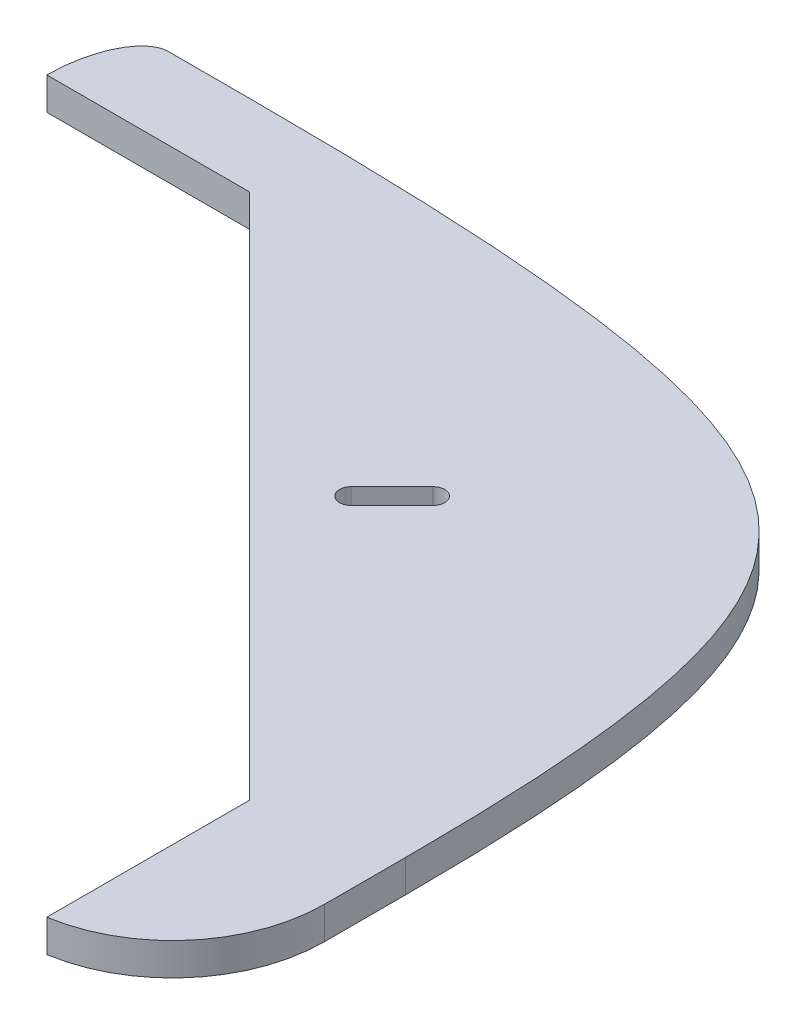
ISO-10303-21;
HEADER;
FILE_DESCRIPTION(('STEP AP214'),'2;1');
FILE_NAME('part.step','',(''),(''),'','','');
FILE_SCHEMA(('AUTOMOTIVE_DESIGN { 1 0 10303 214 1 1 1 1 }'));
ENDSEC;
DATA;
#1=APPLICATION_CONTEXT('core data for automotive mechanical design processes');
#2=APPLICATION_PROTOCOL_DEFINITION('international standard','automotive_design',2000,#1);
#3=PRODUCT_CONTEXT('',#1,'mechanical');
#4=PRODUCT('Part','Part','',(#3));
#5=PRODUCT_RELATED_PRODUCT_CATEGORY('part','',(#4));
#6=PRODUCT_DEFINITION_FORMATION('','',#4);
#7=PRODUCT_DEFINITION_CONTEXT('part definition',#1,'design');
#8=PRODUCT_DEFINITION('design','',#6,#7);
#9=PRODUCT_DEFINITION_SHAPE('','',#8);
#10=(LENGTH_UNIT() NAMED_UNIT(*) SI_UNIT(.MILLI.,.METRE.));
#11=(NAMED_UNIT(*) PLANE_ANGLE_UNIT() SI_UNIT($,.RADIAN.));
#12=(NAMED_UNIT(*) SI_UNIT($,.STERADIAN.) SOLID_ANGLE_UNIT());
#13=UNCERTAINTY_MEASURE_WITH_UNIT(LENGTH_MEASURE(1.E-05),#10,'distance_accuracy_value','');
#14=(GEOMETRIC_REPRESENTATION_CONTEXT(3) GLOBAL_UNCERTAINTY_ASSIGNED_CONTEXT((#13)) GLOBAL_UNIT_ASSIGNED_CONTEXT((#10,
#11,#12)) REPRESENTATION_CONTEXT('',''));
#15=CARTESIAN_POINT('',(0.,0.,0.));
#16=DIRECTION('',(0.,0.,1.));
#17=DIRECTION('',(1.,0.,0.));
#18=AXIS2_PLACEMENT_3D('',#15,#16,#17);
#19=CARTESIAN_POINT('',(12.7,5.08,-12.6999999999999));
#20=DIRECTION('',(0.,-1.,0.));
#21=DIRECTION('',(0.,0.,-1.));
#22=AXIS2_PLACEMENT_3D('',#19,#20,#21);
#23=PLANE('',#22);
#24=DIRECTION('',(-1.,0.,0.));
#25=VECTOR('',#24,1.);
#26=CARTESIAN_POINT('',(0.,5.08,-120.65));
#27=LINE('',#26,#25);
#28=CARTESIAN_POINT('',(12.7,5.08,-120.65));
#29=VERTEX_POINT('',#28);
#30=CARTESIAN_POINT('',(0.,5.08,-120.65));
#31=VERTEX_POINT('',#30);
#32=EDGE_CURVE('E156',#29,#31,#27,.T.);
#33=ORIENTED_EDGE('',*,*,#32,.T.);
#34=CARTESIAN_POINT('',(-6.35,5.08,-107.95));
#35=CARTESIAN_POINT('',(-6.35,5.08,-120.65));
#36=CARTESIAN_POINT('',(0.,5.08,-120.65));
#37=(BOUNDED_CURVE() B_SPLINE_CURVE(2,(#34,#35,#36),.UNSPECIFIED.,.F.,
.F.) B_SPLINE_CURVE_WITH_KNOTS((3,3),(0.,1.),
.UNSPECIFIED.) CURVE() GEOMETRIC_REPRESENTATION_ITEM() RATIONAL_B_SPLINE_CURVE((1.,
0.707106781186548,1.)) REPRESENTATION_ITEM(''));
#38=CARTESIAN_POINT('',(-6.35,5.08,-107.95));
#39=VERTEX_POINT('',#38);
#40=EDGE_CURVE('E12',#31,#39,#37,.F.);
#41=ORIENTED_EDGE('',*,*,#40,.T.);
#42=DIRECTION('',(1.,0.,0.));
#43=VECTOR('',#42,1.);
#44=CARTESIAN_POINT('',(0.,5.08,-107.95));
#45=LINE('',#44,#43);
#46=CARTESIAN_POINT('',(25.4,5.08,-107.95));
#47=VERTEX_POINT('',#46);
#48=EDGE_CURVE('E234',#39,#47,#45,.T.);
#49=ORIENTED_EDGE('',*,*,#48,.T.);
#50=DIRECTION('',(0.707106781186547,0.,0.707106781186547));
#51=VECTOR('',#50,1.);
#52=CARTESIAN_POINT('',(25.4,5.08,-107.95));
#53=LINE('',#52,#51);
#54=CARTESIAN_POINT('',(107.95,5.08,-25.4));
#55=VERTEX_POINT('',#54);
#56=EDGE_CURVE('E152',#47,#55,#53,.T.);
#57=ORIENTED_EDGE('',*,*,#56,.T.);
#58=DIRECTION('',(0.,0.,1.));
#59=VECTOR('',#58,1.);
#60=CARTESIAN_POINT('',(107.95,5.08,-25.4));
#61=LINE('',#60,#59);
#62=CARTESIAN_POINT('',(107.95,5.08,6.35));
#63=VERTEX_POINT('',#62);
#64=EDGE_CURVE('E149',#55,#63,#61,.T.);
#65=ORIENTED_EDGE('',*,*,#64,.T.);
#66=CARTESIAN_POINT('',(104.132871956947,5.08,-17.1592560861063));
#67=DIRECTION('',(0.,1.,0.));
#68=DIRECTION('',(0.,0.,1.));
#69=AXIS2_PLACEMENT_3D('',#66,#67,#68);
#70=CIRCLE('',#69,23.8171280430532);
#71=CARTESIAN_POINT('',(127.95,5.08,-17.1592560861063));
#72=VERTEX_POINT('',#71);
#73=EDGE_CURVE('E136',#72,#63,#70,.F.);
#74=ORIENTED_EDGE('',*,*,#73,.F.);
#75=DIRECTION('',(0.,0.,-1.));
#76=VECTOR('',#75,1.);
#77=CARTESIAN_POINT('',(127.95,5.08,0.));
#78=LINE('',#77,#76);
#79=CARTESIAN_POINT('',(127.95,5.08,-29.8592560861063));
#80=VERTEX_POINT('',#79);
#81=EDGE_CURVE('E146',#72,#80,#78,.T.);
#82=ORIENTED_EDGE('',*,*,#81,.T.);
#83=CARTESIAN_POINT('',(127.95,5.08,-29.8592560861063));
#84=CARTESIAN_POINT('',(127.95,5.08,-120.65));
#85=CARTESIAN_POINT('',(12.7,5.08,-120.65));
#86=(BOUNDED_CURVE() B_SPLINE_CURVE(2,(#83,#84,#85),.UNSPECIFIED.,.F.,
.F.) B_SPLINE_CURVE_WITH_KNOTS((3,3),(0.,1.),
.UNSPECIFIED.) CURVE() GEOMETRIC_REPRESENTATION_ITEM() RATIONAL_B_SPLINE_CURVE((1.,1.88125,1.)) REPRESENTATION_ITEM(''));
#87=EDGE_CURVE('E167',#80,#29,#86,.T.);
#88=ORIENTED_EDGE('',*,*,#87,.T.);
#89=EDGE_LOOP('',(#33,#41,#49,#57,#65,#74,#82,#88));
#90=FACE_BOUND('',#89,.T.);
#91=CARTESIAN_POINT('',(74.6362526601451,5.08,-74.6362526601451));
#92=DIRECTION('',(0.,1.,0.));
#93=DIRECTION('',(0.,0.,1.));
#94=AXIS2_PLACEMENT_3D('',#91,#92,#93);
#95=CIRCLE('',#94,1.79999999999998);
#96=CARTESIAN_POINT('',(73.3634604540094,5.08,-75.9090448662809));
#97=VERTEX_POINT('',#96);
#98=CARTESIAN_POINT('',(75.9090448662809,5.08,-73.3634604540094));
#99=VERTEX_POINT('',#98);
#100=EDGE_CURVE('E192',#97,#99,#95,.T.);
#101=ORIENTED_EDGE('',*,*,#100,.F.);
#102=DIRECTION('',(-0.707106781186548,0.,0.707106781186548));
#103=VECTOR('',#102,1.);
#104=CARTESIAN_POINT('',(73.3634604540094,5.08,-75.9090448662809));
#105=LINE('',#104,#103);
#106=CARTESIAN_POINT('',(79.7981321628069,5.08,-82.3437165750784));
#107=VERTEX_POINT('',#106);
#108=EDGE_CURVE('E299',#107,#97,#105,.T.);
#109=ORIENTED_EDGE('',*,*,#108,.F.);
#110=CARTESIAN_POINT('',(81.0709243689427,5.08,-81.0709243689427));
#111=DIRECTION('',(0.,1.,0.));
#112=DIRECTION('',(0.,0.,1.));
#113=AXIS2_PLACEMENT_3D('',#110,#111,#112);
#114=CIRCLE('',#113,1.79999999999998);
#115=CARTESIAN_POINT('',(82.3437165750784,5.08,-79.7981321628069));
#116=VERTEX_POINT('',#115);
#117=EDGE_CURVE('E359',#116,#107,#114,.T.);
#118=ORIENTED_EDGE('',*,*,#117,.F.);
#119=DIRECTION('',(0.707106781186548,0.,-0.707106781186548));
#120=VECTOR('',#119,1.);
#121=CARTESIAN_POINT('',(75.9090448662809,5.08,-73.3634604540094));
#122=LINE('',#121,#120);
#123=EDGE_CURVE('E358',#99,#116,#122,.T.);
#124=ORIENTED_EDGE('',*,*,#123,.F.);
#125=EDGE_LOOP('',(#101,#109,#118,#124));
#126=FACE_BOUND('',#125,.T.);
#127=ADVANCED_FACE('F39',(#90,#126),#23,.F.);
#128=CARTESIAN_POINT('',(12.7,0.,-12.6999999999999));
#129=DIRECTION('',(0.,-1.,0.));
#130=DIRECTION('',(0.,0.,-1.));
#131=AXIS2_PLACEMENT_3D('',#128,#129,#130);
#132=PLANE('',#131);
#133=DIRECTION('',(1.,0.,0.));
#134=VECTOR('',#133,1.);
#135=CARTESIAN_POINT('',(0.,0.,-107.95));
#136=LINE('',#135,#134);
#137=CARTESIAN_POINT('',(-6.35,0.,-107.95));
#138=VERTEX_POINT('',#137);
#139=CARTESIAN_POINT('',(25.4,0.,-107.95));
#140=VERTEX_POINT('',#139);
#141=EDGE_CURVE('E287',#138,#140,#136,.T.);
#142=ORIENTED_EDGE('',*,*,#141,.F.);
#143=CARTESIAN_POINT('',(0.,0.,-120.65));
#144=CARTESIAN_POINT('',(-6.35,0.,-120.65));
#145=CARTESIAN_POINT('',(-6.35,0.,-107.95));
#146=(BOUNDED_CURVE() B_SPLINE_CURVE(2,(#143,#144,#145),.UNSPECIFIED.,.F.,
.F.) B_SPLINE_CURVE_WITH_KNOTS((3,3),(0.,1.),
.UNSPECIFIED.) CURVE() GEOMETRIC_REPRESENTATION_ITEM() RATIONAL_B_SPLINE_CURVE((1.,
0.707106781186548,1.)) REPRESENTATION_ITEM(''));
#147=CARTESIAN_POINT('',(0.,0.,-120.65));
#148=VERTEX_POINT('',#147);
#149=EDGE_CURVE('E68',#138,#148,#146,.F.);
#150=ORIENTED_EDGE('',*,*,#149,.T.);
#151=DIRECTION('',(-1.,0.,0.));
#152=VECTOR('',#151,1.);
#153=CARTESIAN_POINT('',(0.,0.,-120.65));
#154=LINE('',#153,#152);
#155=CARTESIAN_POINT('',(12.7,0.,-120.65));
#156=VERTEX_POINT('',#155);
#157=EDGE_CURVE('E241',#156,#148,#154,.T.);
#158=ORIENTED_EDGE('',*,*,#157,.F.);
#159=CARTESIAN_POINT('',(127.95,0.,-29.8592560861063));
#160=CARTESIAN_POINT('',(127.95,0.,-120.65));
#161=CARTESIAN_POINT('',(12.7,0.,-120.65));
#162=(BOUNDED_CURVE() B_SPLINE_CURVE(2,(#159,#160,#161),.UNSPECIFIED.,.F.,
.F.) B_SPLINE_CURVE_WITH_KNOTS((3,3),(0.,1.),
.UNSPECIFIED.) CURVE() GEOMETRIC_REPRESENTATION_ITEM() RATIONAL_B_SPLINE_CURVE((1.,1.88125,1.)) REPRESENTATION_ITEM(''));
#163=CARTESIAN_POINT('',(127.95,0.,-29.8592560861063));
#164=VERTEX_POINT('',#163);
#165=EDGE_CURVE('E162',#164,#156,#162,.T.);
#166=ORIENTED_EDGE('',*,*,#165,.F.);
#167=DIRECTION('',(0.,0.,-1.));
#168=VECTOR('',#167,1.);
#169=CARTESIAN_POINT('',(127.95,0.,0.));
#170=LINE('',#169,#168);
#171=CARTESIAN_POINT('',(127.95,0.,-17.1592560861063));
#172=VERTEX_POINT('',#171);
#173=EDGE_CURVE('E164',#172,#164,#170,.T.);
#174=ORIENTED_EDGE('',*,*,#173,.F.);
#175=CARTESIAN_POINT('',(104.132871956947,0.,-17.1592560861063));
#176=DIRECTION('',(0.,-1.,0.));
#177=DIRECTION('',(0.,0.,-1.));
#178=AXIS2_PLACEMENT_3D('',#175,#176,#177);
#179=CIRCLE('',#178,23.8171280430532);
#180=CARTESIAN_POINT('',(107.95,0.,6.35));
#181=VERTEX_POINT('',#180);
#182=EDGE_CURVE('E172',#172,#181,#179,.T.);
#183=ORIENTED_EDGE('',*,*,#182,.T.);
#184=DIRECTION('',(0.,0.,1.));
#185=VECTOR('',#184,1.);
#186=CARTESIAN_POINT('',(107.95,0.,-25.4));
#187=LINE('',#186,#185);
#188=CARTESIAN_POINT('',(107.95,0.,-25.4));
#189=VERTEX_POINT('',#188);
#190=EDGE_CURVE('E161',#189,#181,#187,.T.);
#191=ORIENTED_EDGE('',*,*,#190,.F.);
#192=DIRECTION('',(0.707106781186547,0.,0.707106781186547));
#193=VECTOR('',#192,1.);
#194=CARTESIAN_POINT('',(25.4,0.,-107.95));
#195=LINE('',#194,#193);
#196=EDGE_CURVE('E319',#140,#189,#195,.T.);
#197=ORIENTED_EDGE('',*,*,#196,.F.);
#198=EDGE_LOOP('',(#142,#150,#158,#166,#174,#183,#191,#197));
#199=FACE_BOUND('',#198,.T.);
#200=DIRECTION('',(-0.707106781186548,0.,0.707106781186548));
#201=VECTOR('',#200,1.);
#202=CARTESIAN_POINT('',(73.3634604540094,0.,-75.9090448662809));
#203=LINE('',#202,#201);
#204=CARTESIAN_POINT('',(79.7981321628069,0.,-82.3437165750784));
#205=VERTEX_POINT('',#204);
#206=CARTESIAN_POINT('',(73.3634604540094,0.,-75.9090448662809));
#207=VERTEX_POINT('',#206);
#208=EDGE_CURVE('E304',#205,#207,#203,.T.);
#209=ORIENTED_EDGE('',*,*,#208,.T.);
#210=CARTESIAN_POINT('',(74.6362526601451,0.,-74.6362526601451));
#211=DIRECTION('',(0.,1.,0.));
#212=DIRECTION('',(0.,0.,1.));
#213=AXIS2_PLACEMENT_3D('',#210,#211,#212);
#214=CIRCLE('',#213,1.79999999999998);
#215=CARTESIAN_POINT('',(75.9090448662809,0.,-73.3634604540094));
#216=VERTEX_POINT('',#215);
#217=EDGE_CURVE('E289',#207,#216,#214,.T.);
#218=ORIENTED_EDGE('',*,*,#217,.T.);
#219=DIRECTION('',(0.707106781186548,0.,-0.707106781186548));
#220=VECTOR('',#219,1.);
#221=CARTESIAN_POINT('',(75.9090448662809,0.,-73.3634604540094));
#222=LINE('',#221,#220);
#223=CARTESIAN_POINT('',(82.3437165750784,0.,-79.7981321628069));
#224=VERTEX_POINT('',#223);
#225=EDGE_CURVE('E291',#216,#224,#222,.T.);
#226=ORIENTED_EDGE('',*,*,#225,.T.);
#227=CARTESIAN_POINT('',(81.0709243689427,0.,-81.0709243689427));
#228=DIRECTION('',(0.,1.,0.));
#229=DIRECTION('',(0.,0.,1.));
#230=AXIS2_PLACEMENT_3D('',#227,#228,#229);
#231=CIRCLE('',#230,1.79999999999998);
#232=EDGE_CURVE('E296',#224,#205,#231,.T.);
#233=ORIENTED_EDGE('',*,*,#232,.T.);
#234=EDGE_LOOP('',(#209,#218,#226,#233));
#235=FACE_BOUND('',#234,.T.);
#236=ADVANCED_FACE('F225',(#199,#235),#132,.T.);
#237=CARTESIAN_POINT('',(0.,5.08,-107.95));
#238=DIRECTION('',(0.,0.,-1.));
#239=DIRECTION('',(-1.,0.,0.));
#240=AXIS2_PLACEMENT_3D('',#237,#238,#239);
#241=PLANE('',#240);
#242=ORIENTED_EDGE('',*,*,#141,.T.);
#243=DIRECTION('',(0.,-1.,0.));
#244=VECTOR('',#243,1.);
#245=CARTESIAN_POINT('',(25.4,5.08,-107.95));
#246=LINE('',#245,#244);
#247=EDGE_CURVE('E372',#47,#140,#246,.T.);
#248=ORIENTED_EDGE('',*,*,#247,.F.);
#249=ORIENTED_EDGE('',*,*,#48,.F.);
#250=CARTESIAN_POINT('',(-6.35,-0.253999999999997,-107.95));
#251=CARTESIAN_POINT('',(-6.35,1.60866666666667,-107.95));
#252=CARTESIAN_POINT('',(-6.35,3.47133333333333,-107.95));
#253=CARTESIAN_POINT('',(-6.35,5.334,-107.95));
#254=(BOUNDED_CURVE() B_SPLINE_CURVE(3,(#250,#251,#252,#253),.UNSPECIFIED.,.F.,
.F.) B_SPLINE_CURVE_WITH_KNOTS((4,4),(-0.000254,0.005334),
.UNSPECIFIED.) CURVE() GEOMETRIC_REPRESENTATION_ITEM() RATIONAL_B_SPLINE_CURVE((1.,1.,1.,1.)) REPRESENTATION_ITEM(''));
#255=EDGE_CURVE('E178',#138,#39,#254,.T.);
#256=ORIENTED_EDGE('',*,*,#255,.F.);
#257=EDGE_LOOP('',(#242,#248,#249,#256));
#258=FACE_BOUND('',#257,.T.);
#259=ADVANCED_FACE('F285',(#258),#241,.F.);
#260=CARTESIAN_POINT('',(25.4,5.08,-107.95));
#261=DIRECTION('',(0.707106781186548,0.,-0.707106781186547));
#262=DIRECTION('',(-0.707106781186547,0.,-0.707106781186548));
#263=AXIS2_PLACEMENT_3D('',#260,#261,#262);
#264=PLANE('',#263);
#265=ORIENTED_EDGE('',*,*,#196,.T.);
#266=DIRECTION('',(0.,-1.,0.));
#267=VECTOR('',#266,1.);
#268=CARTESIAN_POINT('',(107.95,5.08,-25.4));
#269=LINE('',#268,#267);
#270=EDGE_CURVE('E377',#55,#189,#269,.T.);
#271=ORIENTED_EDGE('',*,*,#270,.F.);
#272=ORIENTED_EDGE('',*,*,#56,.F.);
#273=ORIENTED_EDGE('',*,*,#247,.T.);
#274=EDGE_LOOP('',(#265,#271,#272,#273));
#275=FACE_BOUND('',#274,.T.);
#276=ADVANCED_FACE('F338',(#275),#264,.F.);
#277=CARTESIAN_POINT('',(107.95,5.08,-25.4));
#278=DIRECTION('',(1.,0.,0.));
#279=DIRECTION('',(0.,0.,-1.));
#280=AXIS2_PLACEMENT_3D('',#277,#278,#279);
#281=PLANE('',#280);
#282=ORIENTED_EDGE('',*,*,#190,.T.);
#283=DIRECTION('',(0.,1.,0.));
#284=VECTOR('',#283,1.);
#285=CARTESIAN_POINT('',(107.95,-166.850187293871,6.35));
#286=LINE('',#285,#284);
#287=EDGE_CURVE('E140',#181,#63,#286,.T.);
#288=ORIENTED_EDGE('',*,*,#287,.T.);
#289=ORIENTED_EDGE('',*,*,#64,.F.);
#290=ORIENTED_EDGE('',*,*,#270,.T.);
#291=EDGE_LOOP('',(#282,#288,#289,#290));
#292=FACE_BOUND('',#291,.T.);
#293=ADVANCED_FACE('F159',(#292),#281,.F.);
#294=CARTESIAN_POINT('',(0.,5.08,-120.65));
#295=DIRECTION('',(0.,0.,1.));
#296=DIRECTION('',(1.,0.,0.));
#297=AXIS2_PLACEMENT_3D('',#294,#295,#296);
#298=PLANE('',#297);
#299=ORIENTED_EDGE('',*,*,#157,.T.);
#300=CARTESIAN_POINT('',(0.,5.334,-120.65));
#301=CARTESIAN_POINT('',(0.,3.47133333333333,-120.65));
#302=CARTESIAN_POINT('',(0.,1.60866666666667,-120.65));
#303=CARTESIAN_POINT('',(0.,-0.253999999999997,-120.65));
#304=(BOUNDED_CURVE() B_SPLINE_CURVE(3,(#300,#301,#302,#303),.UNSPECIFIED.,.F.,
.F.) B_SPLINE_CURVE_WITH_KNOTS((4,4),(-0.000254,0.005334),
.UNSPECIFIED.) CURVE() GEOMETRIC_REPRESENTATION_ITEM() RATIONAL_B_SPLINE_CURVE((1.,1.,1.,1.)) REPRESENTATION_ITEM(''));
#305=EDGE_CURVE('E53',#148,#31,#304,.F.);
#306=ORIENTED_EDGE('',*,*,#305,.T.);
#307=ORIENTED_EDGE('',*,*,#32,.F.);
#308=DIRECTION('',(0.,-1.,0.));
#309=VECTOR('',#308,1.);
#310=CARTESIAN_POINT('',(12.7,5.08,-120.65));
#311=LINE('',#310,#309);
#312=EDGE_CURVE('E323',#29,#156,#311,.T.);
#313=ORIENTED_EDGE('',*,*,#312,.T.);
#314=EDGE_LOOP('',(#299,#306,#307,#313));
#315=FACE_BOUND('',#314,.T.);
#316=ADVANCED_FACE('F220',(#315),#298,.F.);
#317=CARTESIAN_POINT('',(74.6362526601451,5.08,-74.6362526601451));
#318=DIRECTION('',(0.,-1.,0.));
#319=DIRECTION('',(0.,0.,-1.));
#320=AXIS2_PLACEMENT_3D('',#317,#318,#319);
#321=CYLINDRICAL_SURFACE('',#320,1.79999999999998);
#322=ORIENTED_EDGE('',*,*,#217,.F.);
#323=DIRECTION('',(0.,-1.,0.));
#324=VECTOR('',#323,1.);
#325=CARTESIAN_POINT('',(73.3634604540094,5.08,-75.9090448662809));
#326=LINE('',#325,#324);
#327=EDGE_CURVE('E306',#97,#207,#326,.T.);
#328=ORIENTED_EDGE('',*,*,#327,.F.);
#329=ORIENTED_EDGE('',*,*,#100,.T.);
#330=DIRECTION('',(0.,-1.,0.));
#331=VECTOR('',#330,1.);
#332=CARTESIAN_POINT('',(75.9090448662809,5.08,-73.3634604540094));
#333=LINE('',#332,#331);
#334=EDGE_CURVE('E313',#99,#216,#333,.T.);
#335=ORIENTED_EDGE('',*,*,#334,.T.);
#336=EDGE_LOOP('',(#322,#328,#329,#335));
#337=FACE_BOUND('',#336,.T.);
#338=ADVANCED_FACE('F216',(#337),#321,.F.);
#339=CARTESIAN_POINT('',(75.9090448662809,5.08,-73.3634604540094));
#340=DIRECTION('',(-0.707106781186548,0.,-0.707106781186548));
#341=DIRECTION('',(-0.707106781186548,0.,0.707106781186548));
#342=AXIS2_PLACEMENT_3D('',#339,#340,#341);
#343=PLANE('',#342);
#344=ORIENTED_EDGE('',*,*,#225,.F.);
#345=ORIENTED_EDGE('',*,*,#334,.F.);
#346=ORIENTED_EDGE('',*,*,#123,.T.);
#347=DIRECTION('',(0.,-1.,0.));
#348=VECTOR('',#347,1.);
#349=CARTESIAN_POINT('',(82.3437165750784,5.08,-79.7981321628069));
#350=LINE('',#349,#348);
#351=EDGE_CURVE('E311',#116,#224,#350,.T.);
#352=ORIENTED_EDGE('',*,*,#351,.T.);
#353=EDGE_LOOP('',(#344,#345,#346,#352));
#354=FACE_BOUND('',#353,.T.);
#355=ADVANCED_FACE('F212',(#354),#343,.T.);
#356=CARTESIAN_POINT('',(81.0709243689427,5.08,-81.0709243689427));
#357=DIRECTION('',(0.,-1.,0.));
#358=DIRECTION('',(0.,0.,-1.));
#359=AXIS2_PLACEMENT_3D('',#356,#357,#358);
#360=CYLINDRICAL_SURFACE('',#359,1.79999999999998);
#361=ORIENTED_EDGE('',*,*,#232,.F.);
#362=ORIENTED_EDGE('',*,*,#351,.F.);
#363=ORIENTED_EDGE('',*,*,#117,.T.);
#364=DIRECTION('',(0.,-1.,0.));
#365=VECTOR('',#364,1.);
#366=CARTESIAN_POINT('',(79.7981321628069,5.08,-82.3437165750784));
#367=LINE('',#366,#365);
#368=EDGE_CURVE('E309',#107,#205,#367,.T.);
#369=ORIENTED_EDGE('',*,*,#368,.T.);
#370=EDGE_LOOP('',(#361,#362,#363,#369));
#371=FACE_BOUND('',#370,.T.);
#372=ADVANCED_FACE('F208',(#371),#360,.F.);
#373=CARTESIAN_POINT('',(73.3634604540094,5.08,-75.9090448662809));
#374=DIRECTION('',(0.707106781186548,0.,0.707106781186548));
#375=DIRECTION('',(0.707106781186548,0.,-0.707106781186548));
#376=AXIS2_PLACEMENT_3D('',#373,#374,#375);
#377=PLANE('',#376);
#378=ORIENTED_EDGE('',*,*,#208,.F.);
#379=ORIENTED_EDGE('',*,*,#368,.F.);
#380=ORIENTED_EDGE('',*,*,#108,.T.);
#381=ORIENTED_EDGE('',*,*,#327,.T.);
#382=EDGE_LOOP('',(#378,#379,#380,#381));
#383=FACE_BOUND('',#382,.T.);
#384=ADVANCED_FACE('F205',(#383),#377,.T.);
#385=CARTESIAN_POINT('',(0.,-0.253999999999997,-120.65));
#386=CARTESIAN_POINT('',(0.,1.60866666666667,-120.65));
#387=CARTESIAN_POINT('',(0.,3.47133333333333,-120.65));
#388=CARTESIAN_POINT('',(0.,5.334,-120.65));
#389=CARTESIAN_POINT('',(-6.35,-0.254000000000002,-120.65));
#390=CARTESIAN_POINT('',(-6.35,1.60866666666667,-120.65));
#391=CARTESIAN_POINT('',(-6.35,3.47133333333333,-120.65));
#392=CARTESIAN_POINT('',(-6.35,5.334,-120.65));
#393=CARTESIAN_POINT('',(-6.35,-0.253999999999997,-107.95));
#394=CARTESIAN_POINT('',(-6.35,1.60866666666667,-107.95));
#395=CARTESIAN_POINT('',(-6.35,3.47133333333333,-107.95));
#396=CARTESIAN_POINT('',(-6.35,5.334,-107.95));
#397=(BOUNDED_SURFACE() B_SPLINE_SURFACE(2,3,((#385,#386,#387,#388),(#389,#390,#391,#392),(#393,
#394,#395,#396)),.UNSPECIFIED.,.F.,.F.,.F.) B_SPLINE_SURFACE_WITH_KNOTS((3,3),(4,4),(0.,1.),
(-0.000254,0.005334),
.UNSPECIFIED.) GEOMETRIC_REPRESENTATION_ITEM() RATIONAL_B_SPLINE_SURFACE(((1.,1.,1.,1.),
(0.707106781186548,0.707106781186548,0.707106781186548,0.707106781186548),(1.,1.,1.,1.))) REPRESENTATION_ITEM('') SURFACE());
#398=ORIENTED_EDGE('',*,*,#40,.F.);
#399=ORIENTED_EDGE('',*,*,#305,.F.);
#400=ORIENTED_EDGE('',*,*,#149,.F.);
#401=ORIENTED_EDGE('',*,*,#255,.T.);
#402=EDGE_LOOP('',(#398,#399,#400,#401));
#403=FACE_BOUND('',#402,.T.);
#404=ADVANCED_FACE('F42',(#403),#397,.T.);
#405=CARTESIAN_POINT('',(127.95,-166.850187293871,-29.8592560861063));
#406=CARTESIAN_POINT('',(127.95,-166.850187293871,-120.65));
#407=CARTESIAN_POINT('',(12.7,-166.850187293871,-120.65));
#408=(BOUNDED_CURVE() B_SPLINE_CURVE(2,(#405,#406,#407),.UNSPECIFIED.,.F.,
.F.) B_SPLINE_CURVE_WITH_KNOTS((3,3),(0.,1.),
.UNSPECIFIED.) CURVE() GEOMETRIC_REPRESENTATION_ITEM() RATIONAL_B_SPLINE_CURVE((1.,1.88125,1.)) REPRESENTATION_ITEM(''));
#409=DIRECTION('',(0.,1.,0.));
#410=VECTOR('',#409,1.);
#411=SURFACE_OF_LINEAR_EXTRUSION('',#408,#410);
#412=DIRECTION('',(0.,1.,0.));
#413=VECTOR('',#412,1.);
#414=CARTESIAN_POINT('',(127.95,-166.850187293871,-29.8592560861063));
#415=LINE('',#414,#413);
#416=EDGE_CURVE('E179',#164,#80,#415,.T.);
#417=ORIENTED_EDGE('',*,*,#416,.F.);
#418=ORIENTED_EDGE('',*,*,#165,.T.);
#419=ORIENTED_EDGE('',*,*,#312,.F.);
#420=ORIENTED_EDGE('',*,*,#87,.F.);
#421=EDGE_LOOP('',(#417,#418,#419,#420));
#422=FACE_BOUND('',#421,.T.);
#423=ADVANCED_FACE('F198',(#422),#411,.T.);
#424=CARTESIAN_POINT('',(127.95,-166.850187293871,0.));
#425=DIRECTION('',(1.,0.,0.));
#426=DIRECTION('',(0.,0.,-1.));
#427=AXIS2_PLACEMENT_3D('',#424,#425,#426);
#428=PLANE('',#427);
#429=DIRECTION('',(0.,1.,0.));
#430=VECTOR('',#429,1.);
#431=CARTESIAN_POINT('',(127.95,-166.850187293871,-17.1592560861063));
#432=LINE('',#431,#430);
#433=EDGE_CURVE('E142',#172,#72,#432,.T.);
#434=ORIENTED_EDGE('',*,*,#433,.F.);
#435=ORIENTED_EDGE('',*,*,#173,.T.);
#436=ORIENTED_EDGE('',*,*,#416,.T.);
#437=ORIENTED_EDGE('',*,*,#81,.F.);
#438=EDGE_LOOP('',(#434,#435,#436,#437));
#439=FACE_BOUND('',#438,.T.);
#440=ADVANCED_FACE('F202',(#439),#428,.T.);
#441=CARTESIAN_POINT('',(104.132871956947,-166.850187293871,-17.1592560861063));
#442=DIRECTION('',(0.,1.,0.));
#443=DIRECTION('',(0.,0.,1.));
#444=AXIS2_PLACEMENT_3D('',#441,#442,#443);
#445=CYLINDRICAL_SURFACE('',#444,23.8171280430532);
#446=ORIENTED_EDGE('',*,*,#182,.F.);
#447=ORIENTED_EDGE('',*,*,#433,.T.);
#448=ORIENTED_EDGE('',*,*,#73,.T.);
#449=ORIENTED_EDGE('',*,*,#287,.F.);
#450=EDGE_LOOP('',(#446,#447,#448,#449));
#451=FACE_BOUND('',#450,.T.);
#452=ADVANCED_FACE('F138',(#451),#445,.T.);
#453=CLOSED_SHELL('',(#127,#236,#259,#276,#293,#316,#338,#355,#372,#384,#404,#423,#440,#452));
#454=MANIFOLD_SOLID_BREP('B2',#453);
#455=ADVANCED_BREP_SHAPE_REPRESENTATION('',(#18,#454),#14);
#456=SHAPE_DEFINITION_REPRESENTATION(#9,#455);
ENDSEC;
END-ISO-10303-21;
